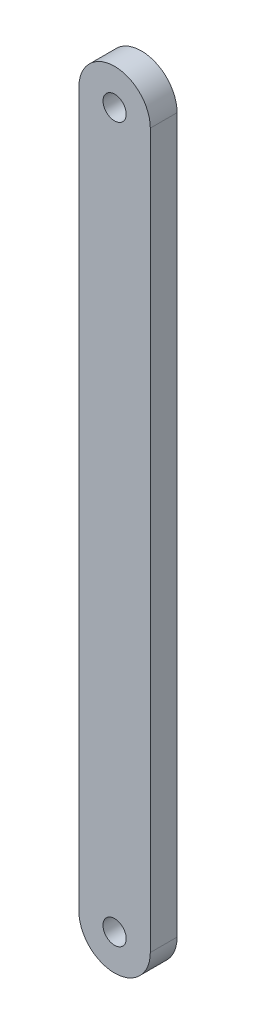
ISO-10303-21;
HEADER;
FILE_DESCRIPTION(('STEP AP214'),'2;1');
FILE_NAME('part.step','',(''),(''),'','','');
FILE_SCHEMA(('AUTOMOTIVE_DESIGN { 1 0 10303 214 1 1 1 1 }'));
ENDSEC;
DATA;
#1=APPLICATION_CONTEXT('core data for automotive mechanical design processes');
#2=APPLICATION_PROTOCOL_DEFINITION('international standard','automotive_design',2000,#1);
#3=PRODUCT_CONTEXT('',#1,'mechanical');
#4=PRODUCT('Part','Part','',(#3));
#5=PRODUCT_RELATED_PRODUCT_CATEGORY('part','',(#4));
#6=PRODUCT_DEFINITION_FORMATION('','',#4);
#7=PRODUCT_DEFINITION_CONTEXT('part definition',#1,'design');
#8=PRODUCT_DEFINITION('design','',#6,#7);
#9=PRODUCT_DEFINITION_SHAPE('','',#8);
#10=(LENGTH_UNIT() NAMED_UNIT(*) SI_UNIT(.MILLI.,.METRE.));
#11=(NAMED_UNIT(*) PLANE_ANGLE_UNIT() SI_UNIT($,.RADIAN.));
#12=(NAMED_UNIT(*) SI_UNIT($,.STERADIAN.) SOLID_ANGLE_UNIT());
#13=UNCERTAINTY_MEASURE_WITH_UNIT(LENGTH_MEASURE(1.E-05),#10,'distance_accuracy_value','');
#14=(GEOMETRIC_REPRESENTATION_CONTEXT(3) GLOBAL_UNCERTAINTY_ASSIGNED_CONTEXT((#13)) GLOBAL_UNIT_ASSIGNED_CONTEXT((#10,
#11,#12)) REPRESENTATION_CONTEXT('',''));
#15=CARTESIAN_POINT('',(0.,0.,0.));
#16=DIRECTION('',(0.,0.,1.));
#17=DIRECTION('',(1.,0.,0.));
#18=AXIS2_PLACEMENT_3D('',#15,#16,#17);
#19=CARTESIAN_POINT('',(51.4999999987979,80.0001000004622,3.));
#20=DIRECTION('',(0.,0.,1.));
#21=DIRECTION('',(1.,0.,0.));
#22=AXIS2_PLACEMENT_3D('',#19,#20,#21);
#23=PLANE('',#22);
#24=CARTESIAN_POINT('',(51.5000999977619,4.99977620052E-05,3.));
#25=DIRECTION('',(0.,0.,1.));
#26=DIRECTION('',(1.,0.,0.));
#27=AXIS2_PLACEMENT_3D('',#24,#25,#26);
#28=CIRCLE('',#27,1.3);
#29=CARTESIAN_POINT('',(52.8000999977619,4.99977620052E-05,3.));
#30=VERTEX_POINT('',#29);
#31=EDGE_CURVE('E101',#30,#30,#28,.T.);
#32=ORIENTED_EDGE('',*,*,#31,.F.);
#33=EDGE_LOOP('',(#32));
#34=FACE_BOUND('',#33,.T.);
#35=CARTESIAN_POINT('',(51.4999999987979,80.0001000004622,3.));
#36=DIRECTION('',(0.,0.,1.));
#37=DIRECTION('',(1.,0.,0.));
#38=AXIS2_PLACEMENT_3D('',#35,#36,#37);
#39=CIRCLE('',#38,3.99989999973548);
#40=CARTESIAN_POINT('',(55.4998999982209,80.0000500009245,3.));
#41=VERTEX_POINT('',#40);
#42=CARTESIAN_POINT('',(47.5000999993749,80.00015,3.));
#43=VERTEX_POINT('',#42);
#44=EDGE_CURVE('E86',#41,#43,#39,.T.);
#45=ORIENTED_EDGE('',*,*,#44,.T.);
#46=DIRECTION('',(0.,-1.,0.));
#47=VECTOR('',#46,1.);
#48=CARTESIAN_POINT('',(47.5000999993749,80.00015,3.));
#49=LINE('',#48,#47);
#50=CARTESIAN_POINT('',(47.500099999375,4.99993777578614E-05,3.));
#51=VERTEX_POINT('',#50);
#52=EDGE_CURVE('E81',#43,#51,#49,.T.);
#53=ORIENTED_EDGE('',*,*,#52,.T.);
#54=CARTESIAN_POINT('',(51.4999999987979,4.99993777591479E-05,3.));
#55=DIRECTION('',(0.,0.,1.));
#56=DIRECTION('',(1.,0.,0.));
#57=AXIS2_PLACEMENT_3D('',#54,#55,#56);
#58=CIRCLE('',#57,3.99989999942295);
#59=CARTESIAN_POINT('',(55.4998999982209,4.99993777617958E-05,3.));
#60=VERTEX_POINT('',#59);
#61=EDGE_CURVE('E84',#51,#60,#58,.T.);
#62=ORIENTED_EDGE('',*,*,#61,.T.);
#63=DIRECTION('',(0.,1.,0.));
#64=VECTOR('',#63,1.);
#65=CARTESIAN_POINT('',(55.4998999982209,80.0000500009245,3.));
#66=LINE('',#65,#64);
#67=EDGE_CURVE('E51',#60,#41,#66,.T.);
#68=ORIENTED_EDGE('',*,*,#67,.T.);
#69=EDGE_LOOP('',(#45,#53,#62,#68));
#70=FACE_BOUND('',#69,.T.);
#71=CARTESIAN_POINT('',(51.5000999977621,80.000049997762,3.));
#72=DIRECTION('',(0.,0.,1.));
#73=DIRECTION('',(1.,0.,0.));
#74=AXIS2_PLACEMENT_3D('',#71,#72,#73);
#75=CIRCLE('',#74,1.3);
#76=CARTESIAN_POINT('',(52.8000999977621,80.000049997762,3.));
#77=VERTEX_POINT('',#76);
#78=EDGE_CURVE('E116',#77,#77,#75,.T.);
#79=ORIENTED_EDGE('',*,*,#78,.F.);
#80=EDGE_LOOP('',(#79));
#81=FACE_BOUND('',#80,.T.);
#82=ADVANCED_FACE('F34',(#34,#70,#81),#23,.T.);
#83=CARTESIAN_POINT('',(51.4999999987979,80.0001000004622,0.));
#84=DIRECTION('',(0.,0.,1.));
#85=DIRECTION('',(1.,0.,0.));
#86=AXIS2_PLACEMENT_3D('',#83,#84,#85);
#87=PLANE('',#86);
#88=CARTESIAN_POINT('',(51.4999999987979,80.0001000004622,0.));
#89=DIRECTION('',(0.,0.,1.));
#90=DIRECTION('',(1.,0.,0.));
#91=AXIS2_PLACEMENT_3D('',#88,#89,#90);
#92=CIRCLE('',#91,3.99989999973548);
#93=CARTESIAN_POINT('',(55.4998999982209,80.0000500009245,0.));
#94=VERTEX_POINT('',#93);
#95=CARTESIAN_POINT('',(47.5000999993749,80.00015,0.));
#96=VERTEX_POINT('',#95);
#97=EDGE_CURVE('E98',#94,#96,#92,.T.);
#98=ORIENTED_EDGE('',*,*,#97,.F.);
#99=DIRECTION('',(0.,1.,0.));
#100=VECTOR('',#99,1.);
#101=CARTESIAN_POINT('',(55.4998999982209,80.0000500009245,0.));
#102=LINE('',#101,#100);
#103=CARTESIAN_POINT('',(55.4998999982209,4.99993777617958E-05,0.));
#104=VERTEX_POINT('',#103);
#105=EDGE_CURVE('E74',#104,#94,#102,.T.);
#106=ORIENTED_EDGE('',*,*,#105,.F.);
#107=CARTESIAN_POINT('',(51.4999999987979,4.99993777591479E-05,0.));
#108=DIRECTION('',(0.,0.,1.));
#109=DIRECTION('',(1.,0.,0.));
#110=AXIS2_PLACEMENT_3D('',#107,#108,#109);
#111=CIRCLE('',#110,3.99989999942295);
#112=CARTESIAN_POINT('',(47.500099999375,4.99993777578614E-05,0.));
#113=VERTEX_POINT('',#112);
#114=EDGE_CURVE('E68',#113,#104,#111,.T.);
#115=ORIENTED_EDGE('',*,*,#114,.F.);
#116=DIRECTION('',(0.,-1.,0.));
#117=VECTOR('',#116,1.);
#118=CARTESIAN_POINT('',(47.5000999993749,80.00015,0.));
#119=LINE('',#118,#117);
#120=EDGE_CURVE('E90',#96,#113,#119,.T.);
#121=ORIENTED_EDGE('',*,*,#120,.F.);
#122=EDGE_LOOP('',(#98,#106,#115,#121));
#123=FACE_BOUND('',#122,.T.);
#124=CARTESIAN_POINT('',(51.5000999977619,4.99977620052E-05,0.));
#125=DIRECTION('',(0.,0.,1.));
#126=DIRECTION('',(1.,0.,0.));
#127=AXIS2_PLACEMENT_3D('',#124,#125,#126);
#128=CIRCLE('',#127,1.3);
#129=CARTESIAN_POINT('',(52.8000999977619,4.99977620052E-05,0.));
#130=VERTEX_POINT('',#129);
#131=EDGE_CURVE('E113',#130,#130,#128,.T.);
#132=ORIENTED_EDGE('',*,*,#131,.T.);
#133=EDGE_LOOP('',(#132));
#134=FACE_BOUND('',#133,.T.);
#135=CARTESIAN_POINT('',(51.5000999977621,80.000049997762,0.));
#136=DIRECTION('',(0.,0.,1.));
#137=DIRECTION('',(1.,0.,0.));
#138=AXIS2_PLACEMENT_3D('',#135,#136,#137);
#139=CIRCLE('',#138,1.3);
#140=CARTESIAN_POINT('',(52.8000999977621,80.000049997762,0.));
#141=VERTEX_POINT('',#140);
#142=EDGE_CURVE('E119',#141,#141,#139,.T.);
#143=ORIENTED_EDGE('',*,*,#142,.T.);
#144=EDGE_LOOP('',(#143));
#145=FACE_BOUND('',#144,.T.);
#146=ADVANCED_FACE('F109',(#123,#134,#145),#87,.F.);
#147=CARTESIAN_POINT('',(51.4999999987979,80.0001000004622,3.));
#148=DIRECTION('',(0.,0.,-1.));
#149=DIRECTION('',(-1.,0.,0.));
#150=AXIS2_PLACEMENT_3D('',#147,#148,#149);
#151=CYLINDRICAL_SURFACE('',#150,3.99989999973548);
#152=ORIENTED_EDGE('',*,*,#97,.T.);
#153=DIRECTION('',(0.,0.,-1.));
#154=VECTOR('',#153,1.);
#155=CARTESIAN_POINT('',(47.5000999993749,80.00015,3.));
#156=LINE('',#155,#154);
#157=EDGE_CURVE('E11',#43,#96,#156,.T.);
#158=ORIENTED_EDGE('',*,*,#157,.F.);
#159=ORIENTED_EDGE('',*,*,#44,.F.);
#160=DIRECTION('',(0.,0.,-1.));
#161=VECTOR('',#160,1.);
#162=CARTESIAN_POINT('',(55.4998999982209,80.0000500009245,3.));
#163=LINE('',#162,#161);
#164=EDGE_CURVE('E94',#41,#94,#163,.T.);
#165=ORIENTED_EDGE('',*,*,#164,.T.);
#166=EDGE_LOOP('',(#152,#158,#159,#165));
#167=FACE_BOUND('',#166,.T.);
#168=ADVANCED_FACE('F36',(#167),#151,.T.);
#169=CARTESIAN_POINT('',(47.5000999993749,80.00015,3.));
#170=DIRECTION('',(1.,0.,0.));
#171=DIRECTION('',(0.,1.,0.));
#172=AXIS2_PLACEMENT_3D('',#169,#170,#171);
#173=PLANE('',#172);
#174=ORIENTED_EDGE('',*,*,#120,.T.);
#175=DIRECTION('',(0.,0.,-1.));
#176=VECTOR('',#175,1.);
#177=CARTESIAN_POINT('',(47.500099999375,4.99993777578614E-05,3.));
#178=LINE('',#177,#176);
#179=EDGE_CURVE('E43',#51,#113,#178,.T.);
#180=ORIENTED_EDGE('',*,*,#179,.F.);
#181=ORIENTED_EDGE('',*,*,#52,.F.);
#182=ORIENTED_EDGE('',*,*,#157,.T.);
#183=EDGE_LOOP('',(#174,#180,#181,#182));
#184=FACE_BOUND('',#183,.T.);
#185=ADVANCED_FACE('F89',(#184),#173,.F.);
#186=CARTESIAN_POINT('',(51.4999999987979,4.99993777591479E-05,3.));
#187=DIRECTION('',(0.,0.,-1.));
#188=DIRECTION('',(-1.,0.,0.));
#189=AXIS2_PLACEMENT_3D('',#186,#187,#188);
#190=CYLINDRICAL_SURFACE('',#189,3.99989999942295);
#191=ORIENTED_EDGE('',*,*,#114,.T.);
#192=DIRECTION('',(0.,0.,-1.));
#193=VECTOR('',#192,1.);
#194=CARTESIAN_POINT('',(55.4998999982209,4.99993777617958E-05,3.));
#195=LINE('',#194,#193);
#196=EDGE_CURVE('E91',#60,#104,#195,.T.);
#197=ORIENTED_EDGE('',*,*,#196,.F.);
#198=ORIENTED_EDGE('',*,*,#61,.F.);
#199=ORIENTED_EDGE('',*,*,#179,.T.);
#200=EDGE_LOOP('',(#191,#197,#198,#199));
#201=FACE_BOUND('',#200,.T.);
#202=ADVANCED_FACE('F92',(#201),#190,.T.);
#203=CARTESIAN_POINT('',(55.4998999982209,80.0000500009245,3.));
#204=DIRECTION('',(-1.,0.,0.));
#205=DIRECTION('',(0.,0.,1.));
#206=AXIS2_PLACEMENT_3D('',#203,#204,#205);
#207=PLANE('',#206);
#208=ORIENTED_EDGE('',*,*,#105,.T.);
#209=ORIENTED_EDGE('',*,*,#164,.F.);
#210=ORIENTED_EDGE('',*,*,#67,.F.);
#211=ORIENTED_EDGE('',*,*,#196,.T.);
#212=EDGE_LOOP('',(#208,#209,#210,#211));
#213=FACE_BOUND('',#212,.T.);
#214=ADVANCED_FACE('F106',(#213),#207,.F.);
#215=CARTESIAN_POINT('',(51.5000999977619,4.99977620052E-05,3.));
#216=DIRECTION('',(0.,0.,-1.));
#217=DIRECTION('',(-1.,0.,0.));
#218=AXIS2_PLACEMENT_3D('',#215,#216,#217);
#219=CYLINDRICAL_SURFACE('',#218,1.3);
#220=ORIENTED_EDGE('',*,*,#31,.T.);
#221=EDGE_LOOP('',(#220));
#222=FACE_BOUND('',#221,.T.);
#223=ORIENTED_EDGE('',*,*,#131,.F.);
#224=EDGE_LOOP('',(#223));
#225=FACE_BOUND('',#224,.T.);
#226=ADVANCED_FACE('F136',(#222,#225),#219,.F.);
#227=CARTESIAN_POINT('',(51.5000999977621,80.000049997762,3.));
#228=DIRECTION('',(0.,0.,-1.));
#229=DIRECTION('',(-1.,0.,0.));
#230=AXIS2_PLACEMENT_3D('',#227,#228,#229);
#231=CYLINDRICAL_SURFACE('',#230,1.3);
#232=ORIENTED_EDGE('',*,*,#78,.T.);
#233=EDGE_LOOP('',(#232));
#234=FACE_BOUND('',#233,.T.);
#235=ORIENTED_EDGE('',*,*,#142,.F.);
#236=EDGE_LOOP('',(#235));
#237=FACE_BOUND('',#236,.T.);
#238=ADVANCED_FACE('F125',(#234,#237),#231,.F.);
#239=CLOSED_SHELL('',(#82,#146,#168,#185,#202,#214,#226,#238));
#240=MANIFOLD_SOLID_BREP('B2',#239);
#241=ADVANCED_BREP_SHAPE_REPRESENTATION('',(#18,#240),#14);
#242=SHAPE_DEFINITION_REPRESENTATION(#9,#241);
ENDSEC;
END-ISO-10303-21;
